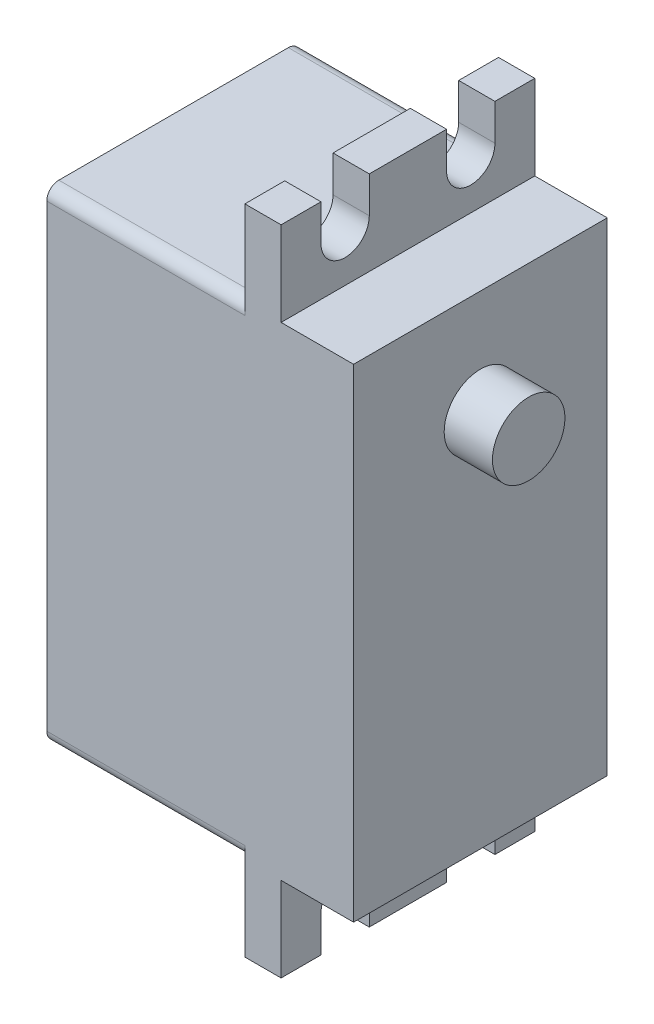
ISO-10303-21;
HEADER;
FILE_DESCRIPTION(('STEP AP214'),'2;1');
FILE_NAME('part.step','',(''),(''),'','','');
FILE_SCHEMA(('AUTOMOTIVE_DESIGN { 1 0 10303 214 1 1 1 1 }'));
ENDSEC;
DATA;
#1=APPLICATION_CONTEXT('core data for automotive mechanical design processes');
#2=APPLICATION_PROTOCOL_DEFINITION('international standard','automotive_design',2000,#1);
#3=PRODUCT_CONTEXT('',#1,'mechanical');
#4=PRODUCT('Part','Part','',(#3));
#5=PRODUCT_RELATED_PRODUCT_CATEGORY('part','',(#4));
#6=PRODUCT_DEFINITION_FORMATION('','',#4);
#7=PRODUCT_DEFINITION_CONTEXT('part definition',#1,'design');
#8=PRODUCT_DEFINITION('design','',#6,#7);
#9=PRODUCT_DEFINITION_SHAPE('','',#8);
#10=(LENGTH_UNIT() NAMED_UNIT(*) SI_UNIT(.MILLI.,.METRE.));
#11=(NAMED_UNIT(*) PLANE_ANGLE_UNIT() SI_UNIT($,.RADIAN.));
#12=(NAMED_UNIT(*) SI_UNIT($,.STERADIAN.) SOLID_ANGLE_UNIT());
#13=UNCERTAINTY_MEASURE_WITH_UNIT(LENGTH_MEASURE(1.E-05),#10,'distance_accuracy_value','');
#14=(GEOMETRIC_REPRESENTATION_CONTEXT(3) GLOBAL_UNCERTAINTY_ASSIGNED_CONTEXT((#13)) GLOBAL_UNIT_ASSIGNED_CONTEXT((#10,
#11,#12)) REPRESENTATION_CONTEXT('',''));
#15=CARTESIAN_POINT('',(0.,0.,0.));
#16=DIRECTION('',(0.,0.,1.));
#17=DIRECTION('',(1.,0.,0.));
#18=AXIS2_PLACEMENT_3D('',#15,#16,#17);
#19=CARTESIAN_POINT('',(19.4,0.,0.));
#20=DIRECTION('',(-1.,0.,0.));
#21=DIRECTION('',(0.,0.,1.));
#22=AXIS2_PLACEMENT_3D('',#19,#20,#21);
#23=PLANE('',#22);
#24=DIRECTION('',(0.,0.,-1.));
#25=VECTOR('',#24,1.);
#26=CARTESIAN_POINT('',(19.4,-20.,10.5));
#27=LINE('',#26,#25);
#28=CARTESIAN_POINT('',(19.4,-20.,10.5));
#29=VERTEX_POINT('',#28);
#30=CARTESIAN_POINT('',(19.4,-20.,-10.5));
#31=VERTEX_POINT('',#30);
#32=EDGE_CURVE('E260',#29,#31,#27,.T.);
#33=ORIENTED_EDGE('',*,*,#32,.F.);
#34=DIRECTION('',(0.,-1.,0.));
#35=VECTOR('',#34,1.);
#36=CARTESIAN_POINT('',(19.4,-27.,10.5));
#37=LINE('',#36,#35);
#38=CARTESIAN_POINT('',(19.4,-27.,10.5));
#39=VERTEX_POINT('',#38);
#40=EDGE_CURVE('E385',#29,#39,#37,.T.);
#41=ORIENTED_EDGE('',*,*,#40,.T.);
#42=DIRECTION('',(0.,0.,-1.));
#43=VECTOR('',#42,1.);
#44=CARTESIAN_POINT('',(19.4,-27.,10.5));
#45=LINE('',#44,#43);
#46=CARTESIAN_POINT('',(19.4,-27.,7.200000014));
#47=VERTEX_POINT('',#46);
#48=EDGE_CURVE('E390',#39,#47,#45,.T.);
#49=ORIENTED_EDGE('',*,*,#48,.T.);
#50=DIRECTION('',(0.,1.,0.));
#51=VECTOR('',#50,1.);
#52=CARTESIAN_POINT('',(19.4,-24.,7.200000014));
#53=LINE('',#52,#51);
#54=CARTESIAN_POINT('',(19.4,-24.,7.200000014));
#55=VERTEX_POINT('',#54);
#56=EDGE_CURVE('E279',#47,#55,#53,.T.);
#57=ORIENTED_EDGE('',*,*,#56,.T.);
#58=CARTESIAN_POINT('',(19.4,-24.,5.200000014));
#59=DIRECTION('',(-1.,0.,0.));
#60=DIRECTION('',(0.,0.,1.));
#61=AXIS2_PLACEMENT_3D('',#58,#59,#60);
#62=CIRCLE('',#61,2.);
#63=CARTESIAN_POINT('',(19.4,-24.,3.200000014));
#64=VERTEX_POINT('',#63);
#65=EDGE_CURVE('E276',#55,#64,#62,.T.);
#66=ORIENTED_EDGE('',*,*,#65,.T.);
#67=DIRECTION('',(0.,-1.,0.));
#68=VECTOR('',#67,1.);
#69=CARTESIAN_POINT('',(19.4,-24.,3.200000014));
#70=LINE('',#69,#68);
#71=CARTESIAN_POINT('',(19.4,-27.,3.200000014));
#72=VERTEX_POINT('',#71);
#73=EDGE_CURVE('E282',#64,#72,#70,.T.);
#74=ORIENTED_EDGE('',*,*,#73,.T.);
#75=CARTESIAN_POINT('',(19.4,-27.,-3.200000014));
#76=VERTEX_POINT('',#75);
#77=EDGE_CURVE('E394',#72,#76,#45,.T.);
#78=ORIENTED_EDGE('',*,*,#77,.T.);
#79=DIRECTION('',(0.,-1.,0.));
#80=VECTOR('',#79,1.);
#81=CARTESIAN_POINT('',(19.4,-24.,-3.200000014));
#82=LINE('',#81,#80);
#83=CARTESIAN_POINT('',(19.4,-24.,-3.200000014));
#84=VERTEX_POINT('',#83);
#85=EDGE_CURVE('E306',#84,#76,#82,.T.);
#86=ORIENTED_EDGE('',*,*,#85,.F.);
#87=CARTESIAN_POINT('',(19.4,-24.,-5.200000014));
#88=DIRECTION('',(1.,0.,0.));
#89=DIRECTION('',(0.,0.,-1.));
#90=AXIS2_PLACEMENT_3D('',#87,#88,#89);
#91=CIRCLE('',#90,2.);
#92=CARTESIAN_POINT('',(19.4,-24.,-7.200000014));
#93=VERTEX_POINT('',#92);
#94=EDGE_CURVE('E303',#93,#84,#91,.T.);
#95=ORIENTED_EDGE('',*,*,#94,.F.);
#96=DIRECTION('',(0.,1.,0.));
#97=VECTOR('',#96,1.);
#98=CARTESIAN_POINT('',(19.4,-24.,-7.200000014));
#99=LINE('',#98,#97);
#100=CARTESIAN_POINT('',(19.4,-27.,-7.200000014));
#101=VERTEX_POINT('',#100);
#102=EDGE_CURVE('E309',#101,#93,#99,.T.);
#103=ORIENTED_EDGE('',*,*,#102,.F.);
#104=CARTESIAN_POINT('',(19.4,-27.,-10.5));
#105=VERTEX_POINT('',#104);
#106=EDGE_CURVE('E389',#101,#105,#45,.T.);
#107=ORIENTED_EDGE('',*,*,#106,.T.);
#108=DIRECTION('',(0.,1.,0.));
#109=VECTOR('',#108,1.);
#110=CARTESIAN_POINT('',(19.4,-27.,-10.5));
#111=LINE('',#110,#109);
#112=EDGE_CURVE('E379',#105,#31,#111,.T.);
#113=ORIENTED_EDGE('',*,*,#112,.T.);
#114=EDGE_LOOP('',(#33,#41,#49,#57,#66,#74,#78,#86,#95,#103,#107,#113));
#115=FACE_BOUND('',#114,.T.);
#116=ADVANCED_FACE('F32',(#115),#23,.F.);
#117=DIRECTION('',(0.,0.,1.));
#118=VECTOR('',#117,1.);
#119=CARTESIAN_POINT('',(19.4,20.,10.5));
#120=LINE('',#119,#118);
#121=CARTESIAN_POINT('',(19.4,20.,-10.5));
#122=VERTEX_POINT('',#121);
#123=CARTESIAN_POINT('',(19.4,20.,10.5));
#124=VERTEX_POINT('',#123);
#125=EDGE_CURVE('E853',#122,#124,#120,.T.);
#126=ORIENTED_EDGE('',*,*,#125,.F.);
#127=CARTESIAN_POINT('',(19.4,27.,-10.5));
#128=VERTEX_POINT('',#127);
#129=EDGE_CURVE('E265',#122,#128,#111,.T.);
#130=ORIENTED_EDGE('',*,*,#129,.T.);
#131=DIRECTION('',(0.,0.,1.));
#132=VECTOR('',#131,1.);
#133=CARTESIAN_POINT('',(19.4,27.,10.5));
#134=LINE('',#133,#132);
#135=CARTESIAN_POINT('',(19.4,27.,-7.200000014));
#136=VERTEX_POINT('',#135);
#137=EDGE_CURVE('E382',#128,#136,#134,.T.);
#138=ORIENTED_EDGE('',*,*,#137,.T.);
#139=DIRECTION('',(0.,-1.,0.));
#140=VECTOR('',#139,1.);
#141=CARTESIAN_POINT('',(19.4,24.,-7.200000014));
#142=LINE('',#141,#140);
#143=CARTESIAN_POINT('',(19.4,24.,-7.200000014));
#144=VERTEX_POINT('',#143);
#145=EDGE_CURVE('E332',#136,#144,#142,.T.);
#146=ORIENTED_EDGE('',*,*,#145,.T.);
#147=CARTESIAN_POINT('',(19.4,24.,-5.200000014));
#148=DIRECTION('',(-1.,0.,0.));
#149=DIRECTION('',(0.,0.,-1.));
#150=AXIS2_PLACEMENT_3D('',#147,#148,#149);
#151=CIRCLE('',#150,2.);
#152=CARTESIAN_POINT('',(19.4,24.,-3.200000014));
#153=VERTEX_POINT('',#152);
#154=EDGE_CURVE('E329',#144,#153,#151,.T.);
#155=ORIENTED_EDGE('',*,*,#154,.T.);
#156=DIRECTION('',(0.,1.,0.));
#157=VECTOR('',#156,1.);
#158=CARTESIAN_POINT('',(19.4,24.,-3.200000014));
#159=LINE('',#158,#157);
#160=CARTESIAN_POINT('',(19.4,27.,-3.200000014));
#161=VERTEX_POINT('',#160);
#162=EDGE_CURVE('E335',#153,#161,#159,.T.);
#163=ORIENTED_EDGE('',*,*,#162,.T.);
#164=CARTESIAN_POINT('',(19.4,27.,3.200000014));
#165=VERTEX_POINT('',#164);
#166=EDGE_CURVE('E386',#161,#165,#134,.T.);
#167=ORIENTED_EDGE('',*,*,#166,.T.);
#168=DIRECTION('',(0.,1.,0.));
#169=VECTOR('',#168,1.);
#170=CARTESIAN_POINT('',(19.4,24.,3.200000014));
#171=LINE('',#170,#169);
#172=CARTESIAN_POINT('',(19.4,24.,3.200000014));
#173=VERTEX_POINT('',#172);
#174=EDGE_CURVE('E359',#173,#165,#171,.T.);
#175=ORIENTED_EDGE('',*,*,#174,.F.);
#176=CARTESIAN_POINT('',(19.4,24.,5.200000014));
#177=DIRECTION('',(1.,0.,0.));
#178=DIRECTION('',(0.,0.,1.));
#179=AXIS2_PLACEMENT_3D('',#176,#177,#178);
#180=CIRCLE('',#179,2.);
#181=CARTESIAN_POINT('',(19.4,24.,7.200000014));
#182=VERTEX_POINT('',#181);
#183=EDGE_CURVE('E357',#182,#173,#180,.T.);
#184=ORIENTED_EDGE('',*,*,#183,.F.);
#185=DIRECTION('',(0.,-1.,0.));
#186=VECTOR('',#185,1.);
#187=CARTESIAN_POINT('',(19.4,24.,7.200000014));
#188=LINE('',#187,#186);
#189=CARTESIAN_POINT('',(19.4,27.,7.200000014));
#190=VERTEX_POINT('',#189);
#191=EDGE_CURVE('E362',#190,#182,#188,.T.);
#192=ORIENTED_EDGE('',*,*,#191,.F.);
#193=CARTESIAN_POINT('',(19.4,27.,10.5));
#194=VERTEX_POINT('',#193);
#195=EDGE_CURVE('E381',#190,#194,#134,.T.);
#196=ORIENTED_EDGE('',*,*,#195,.T.);
#197=EDGE_CURVE('E387',#194,#124,#37,.T.);
#198=ORIENTED_EDGE('',*,*,#197,.T.);
#199=EDGE_LOOP('',(#126,#130,#138,#146,#155,#163,#167,#175,#184,#192,#196,#198));
#200=FACE_BOUND('',#199,.T.);
#201=ADVANCED_FACE('F521',(#200),#23,.F.);
#202=CARTESIAN_POINT('',(19.4,-27.,10.5));
#203=DIRECTION('',(0.,1.,0.));
#204=DIRECTION('',(0.,0.,1.));
#205=AXIS2_PLACEMENT_3D('',#202,#203,#204);
#206=PLANE('',#205);
#207=DIRECTION('',(1.,0.,0.));
#208=VECTOR('',#207,1.);
#209=CARTESIAN_POINT('',(-0.001000000000001,-27.,3.200000014));
#210=LINE('',#209,#208);
#211=CARTESIAN_POINT('',(16.4,-27.,3.200000014));
#212=VERTEX_POINT('',#211);
#213=EDGE_CURVE('E289',#212,#72,#210,.T.);
#214=ORIENTED_EDGE('',*,*,#213,.F.);
#215=DIRECTION('',(0.,0.,-1.));
#216=VECTOR('',#215,1.);
#217=CARTESIAN_POINT('',(16.4,-27.,10.5));
#218=LINE('',#217,#216);
#219=CARTESIAN_POINT('',(16.4,-27.,-3.200000014));
#220=VERTEX_POINT('',#219);
#221=EDGE_CURVE('E409',#212,#220,#218,.T.);
#222=ORIENTED_EDGE('',*,*,#221,.T.);
#223=DIRECTION('',(1.,0.,0.));
#224=VECTOR('',#223,1.);
#225=CARTESIAN_POINT('',(-0.001000000000001,-27.,-3.200000014));
#226=LINE('',#225,#224);
#227=EDGE_CURVE('E318',#220,#76,#226,.T.);
#228=ORIENTED_EDGE('',*,*,#227,.T.);
#229=ORIENTED_EDGE('',*,*,#77,.F.);
#230=EDGE_LOOP('',(#214,#222,#228,#229));
#231=FACE_BOUND('',#230,.T.);
#232=ADVANCED_FACE('F527',(#231),#206,.F.);
#233=DIRECTION('',(1.,0.,0.));
#234=VECTOR('',#233,1.);
#235=CARTESIAN_POINT('',(-0.001000000000001,-27.,7.200000014));
#236=LINE('',#235,#234);
#237=CARTESIAN_POINT('',(16.4,-27.,7.200000014));
#238=VERTEX_POINT('',#237);
#239=EDGE_CURVE('E291',#238,#47,#236,.T.);
#240=ORIENTED_EDGE('',*,*,#239,.T.);
#241=ORIENTED_EDGE('',*,*,#48,.F.);
#242=DIRECTION('',(-1.,0.,0.));
#243=VECTOR('',#242,1.);
#244=CARTESIAN_POINT('',(19.4,-27.,10.5));
#245=LINE('',#244,#243);
#246=CARTESIAN_POINT('',(16.4,-27.,10.5));
#247=VERTEX_POINT('',#246);
#248=EDGE_CURVE('E412',#39,#247,#245,.T.);
#249=ORIENTED_EDGE('',*,*,#248,.T.);
#250=EDGE_CURVE('E406',#247,#238,#218,.T.);
#251=ORIENTED_EDGE('',*,*,#250,.T.);
#252=EDGE_LOOP('',(#240,#241,#249,#251));
#253=FACE_BOUND('',#252,.T.);
#254=ADVANCED_FACE('F536',(#253),#206,.F.);
#255=CARTESIAN_POINT('',(16.4,0.,0.));
#256=DIRECTION('',(-1.,0.,0.));
#257=DIRECTION('',(0.,0.,1.));
#258=AXIS2_PLACEMENT_3D('',#255,#256,#257);
#259=PLANE('',#258);
#260=ORIENTED_EDGE('',*,*,#221,.F.);
#261=DIRECTION('',(0.,-1.,0.));
#262=VECTOR('',#261,1.);
#263=CARTESIAN_POINT('',(16.4,-24.,3.200000014));
#264=LINE('',#263,#262);
#265=CARTESIAN_POINT('',(16.4,-24.,3.200000014));
#266=VERTEX_POINT('',#265);
#267=EDGE_CURVE('E269',#266,#212,#264,.T.);
#268=ORIENTED_EDGE('',*,*,#267,.F.);
#269=CARTESIAN_POINT('',(16.4,-24.,5.200000014));
#270=DIRECTION('',(-1.,0.,0.));
#271=DIRECTION('',(0.,0.,1.));
#272=AXIS2_PLACEMENT_3D('',#269,#270,#271);
#273=CIRCLE('',#272,2.);
#274=CARTESIAN_POINT('',(16.4,-24.,7.200000014));
#275=VERTEX_POINT('',#274);
#276=EDGE_CURVE('E266',#275,#266,#273,.T.);
#277=ORIENTED_EDGE('',*,*,#276,.F.);
#278=DIRECTION('',(0.,1.,0.));
#279=VECTOR('',#278,1.);
#280=CARTESIAN_POINT('',(16.4,-24.,7.200000014));
#281=LINE('',#280,#279);
#282=EDGE_CURVE('E288',#238,#275,#281,.T.);
#283=ORIENTED_EDGE('',*,*,#282,.F.);
#284=ORIENTED_EDGE('',*,*,#250,.F.);
#285=DIRECTION('',(0.,-1.,0.));
#286=VECTOR('',#285,1.);
#287=CARTESIAN_POINT('',(16.4,-27.,10.5));
#288=LINE('',#287,#286);
#289=CARTESIAN_POINT('',(16.4,-19.,10.5));
#290=VERTEX_POINT('',#289);
#291=EDGE_CURVE('E401',#290,#247,#288,.T.);
#292=ORIENTED_EDGE('',*,*,#291,.F.);
#293=CARTESIAN_POINT('',(16.4,-19.,9.5));
#294=DIRECTION('',(-1.,0.,0.));
#295=DIRECTION('',(0.,0.,1.));
#296=AXIS2_PLACEMENT_3D('',#293,#294,#295);
#297=CIRCLE('',#296,1.);
#298=CARTESIAN_POINT('',(16.4,-20.,9.5));
#299=VERTEX_POINT('',#298);
#300=EDGE_CURVE('E469',#290,#299,#297,.F.);
#301=ORIENTED_EDGE('',*,*,#300,.T.);
#302=DIRECTION('',(0.,0.,-1.));
#303=VECTOR('',#302,1.);
#304=CARTESIAN_POINT('',(16.4,-20.,10.5));
#305=LINE('',#304,#303);
#306=CARTESIAN_POINT('',(16.4,-20.,-9.5));
#307=VERTEX_POINT('',#306);
#308=EDGE_CURVE('E424',#299,#307,#305,.T.);
#309=ORIENTED_EDGE('',*,*,#308,.T.);
#310=CARTESIAN_POINT('',(16.4,-19.,-9.50000000000001));
#311=DIRECTION('',(-1.,0.,0.));
#312=DIRECTION('',(0.,0.,1.));
#313=AXIS2_PLACEMENT_3D('',#310,#311,#312);
#314=CIRCLE('',#313,1.);
#315=CARTESIAN_POINT('',(16.4,-19.,-10.5));
#316=VERTEX_POINT('',#315);
#317=EDGE_CURVE('E471',#307,#316,#314,.F.);
#318=ORIENTED_EDGE('',*,*,#317,.T.);
#319=DIRECTION('',(0.,1.,0.));
#320=VECTOR('',#319,1.);
#321=CARTESIAN_POINT('',(16.4,-27.,-10.5));
#322=LINE('',#321,#320);
#323=CARTESIAN_POINT('',(16.4,-27.,-10.5));
#324=VERTEX_POINT('',#323);
#325=EDGE_CURVE('E395',#324,#316,#322,.T.);
#326=ORIENTED_EDGE('',*,*,#325,.F.);
#327=CARTESIAN_POINT('',(16.4,-27.,-7.200000014));
#328=VERTEX_POINT('',#327);
#329=EDGE_CURVE('E405',#328,#324,#218,.T.);
#330=ORIENTED_EDGE('',*,*,#329,.F.);
#331=DIRECTION('',(0.,1.,0.));
#332=VECTOR('',#331,1.);
#333=CARTESIAN_POINT('',(16.4,-24.,-7.200000014));
#334=LINE('',#333,#332);
#335=CARTESIAN_POINT('',(16.4,-24.,-7.200000014));
#336=VERTEX_POINT('',#335);
#337=EDGE_CURVE('E300',#328,#336,#334,.T.);
#338=ORIENTED_EDGE('',*,*,#337,.T.);
#339=CARTESIAN_POINT('',(16.4,-24.,-5.200000014));
#340=DIRECTION('',(-1.,0.,0.));
#341=DIRECTION('',(0.,0.,1.));
#342=AXIS2_PLACEMENT_3D('',#339,#340,#341);
#343=CIRCLE('',#342,2.);
#344=CARTESIAN_POINT('',(16.4,-24.,-3.200000014));
#345=VERTEX_POINT('',#344);
#346=EDGE_CURVE('E297',#336,#345,#343,.F.);
#347=ORIENTED_EDGE('',*,*,#346,.T.);
#348=DIRECTION('',(0.,-1.,0.));
#349=VECTOR('',#348,1.);
#350=CARTESIAN_POINT('',(16.4,-24.,-3.200000014));
#351=LINE('',#350,#349);
#352=EDGE_CURVE('E315',#345,#220,#351,.T.);
#353=ORIENTED_EDGE('',*,*,#352,.T.);
#354=EDGE_LOOP('',(#260,#268,#277,#283,#284,#292,#301,#309,#318,#326,#330,#338,#347,#353));
#355=FACE_BOUND('',#354,.T.);
#356=ADVANCED_FACE('F501',(#355),#259,.T.);
#357=ORIENTED_EDGE('',*,*,#106,.F.);
#358=DIRECTION('',(1.,0.,0.));
#359=VECTOR('',#358,1.);
#360=CARTESIAN_POINT('',(-0.001000000000001,-27.,-7.200000014));
#361=LINE('',#360,#359);
#362=EDGE_CURVE('E316',#328,#101,#361,.T.);
#363=ORIENTED_EDGE('',*,*,#362,.F.);
#364=ORIENTED_EDGE('',*,*,#329,.T.);
#365=DIRECTION('',(-1.,0.,0.));
#366=VECTOR('',#365,1.);
#367=CARTESIAN_POINT('',(19.4,-27.,-10.5));
#368=LINE('',#367,#366);
#369=EDGE_CURVE('E393',#105,#324,#368,.T.);
#370=ORIENTED_EDGE('',*,*,#369,.F.);
#371=EDGE_LOOP('',(#357,#363,#364,#370));
#372=FACE_BOUND('',#371,.T.);
#373=ADVANCED_FACE('F535',(#372),#206,.F.);
#374=DIRECTION('',(0.,0.,1.));
#375=VECTOR('',#374,1.);
#376=CARTESIAN_POINT('',(16.4,27.,10.5));
#377=LINE('',#376,#375);
#378=CARTESIAN_POINT('',(16.4,27.,-3.200000014));
#379=VERTEX_POINT('',#378);
#380=CARTESIAN_POINT('',(16.4,27.,3.200000014));
#381=VERTEX_POINT('',#380);
#382=EDGE_CURVE('E402',#379,#381,#377,.T.);
#383=ORIENTED_EDGE('',*,*,#382,.F.);
#384=DIRECTION('',(0.,1.,0.));
#385=VECTOR('',#384,1.);
#386=CARTESIAN_POINT('',(16.4,24.,-3.200000014));
#387=LINE('',#386,#385);
#388=CARTESIAN_POINT('',(16.4,24.,-3.200000014));
#389=VERTEX_POINT('',#388);
#390=EDGE_CURVE('E327',#389,#379,#387,.T.);
#391=ORIENTED_EDGE('',*,*,#390,.F.);
#392=CARTESIAN_POINT('',(16.4,24.,-5.200000014));
#393=DIRECTION('',(-1.,0.,0.));
#394=DIRECTION('',(0.,0.,1.));
#395=AXIS2_PLACEMENT_3D('',#392,#393,#394);
#396=CIRCLE('',#395,2.);
#397=CARTESIAN_POINT('',(16.4,24.,-7.200000014));
#398=VERTEX_POINT('',#397);
#399=EDGE_CURVE('E324',#398,#389,#396,.T.);
#400=ORIENTED_EDGE('',*,*,#399,.F.);
#401=DIRECTION('',(0.,-1.,0.));
#402=VECTOR('',#401,1.);
#403=CARTESIAN_POINT('',(16.4,24.,-7.200000014));
#404=LINE('',#403,#402);
#405=CARTESIAN_POINT('',(16.4,27.,-7.200000014));
#406=VERTEX_POINT('',#405);
#407=EDGE_CURVE('E341',#406,#398,#404,.T.);
#408=ORIENTED_EDGE('',*,*,#407,.F.);
#409=CARTESIAN_POINT('',(16.4,27.,-10.5));
#410=VERTEX_POINT('',#409);
#411=EDGE_CURVE('E398',#410,#406,#377,.T.);
#412=ORIENTED_EDGE('',*,*,#411,.F.);
#413=CARTESIAN_POINT('',(16.4,19.,-10.5));
#414=VERTEX_POINT('',#413);
#415=EDGE_CURVE('E378',#414,#410,#322,.T.);
#416=ORIENTED_EDGE('',*,*,#415,.F.);
#417=CARTESIAN_POINT('',(16.4,19.,-9.5));
#418=DIRECTION('',(-1.,0.,0.));
#419=DIRECTION('',(0.,0.,1.));
#420=AXIS2_PLACEMENT_3D('',#417,#418,#419);
#421=CIRCLE('',#420,1.);
#422=CARTESIAN_POINT('',(16.4,20.,-9.5));
#423=VERTEX_POINT('',#422);
#424=EDGE_CURVE('E11',#414,#423,#421,.F.);
#425=ORIENTED_EDGE('',*,*,#424,.T.);
#426=DIRECTION('',(0.,0.,1.));
#427=VECTOR('',#426,1.);
#428=CARTESIAN_POINT('',(16.4,20.,10.5));
#429=LINE('',#428,#427);
#430=CARTESIAN_POINT('',(16.4,20.,9.5));
#431=VERTEX_POINT('',#430);
#432=EDGE_CURVE('E422',#423,#431,#429,.T.);
#433=ORIENTED_EDGE('',*,*,#432,.T.);
#434=CARTESIAN_POINT('',(16.4,19.,9.5));
#435=DIRECTION('',(-1.,0.,0.));
#436=DIRECTION('',(0.,0.,1.));
#437=AXIS2_PLACEMENT_3D('',#434,#435,#436);
#438=CIRCLE('',#437,1.);
#439=CARTESIAN_POINT('',(16.4,19.,10.5));
#440=VERTEX_POINT('',#439);
#441=EDGE_CURVE('E40',#431,#440,#438,.F.);
#442=ORIENTED_EDGE('',*,*,#441,.T.);
#443=CARTESIAN_POINT('',(16.4,27.,10.5));
#444=VERTEX_POINT('',#443);
#445=EDGE_CURVE('E403',#444,#440,#288,.T.);
#446=ORIENTED_EDGE('',*,*,#445,.F.);
#447=CARTESIAN_POINT('',(16.4,27.,7.200000014));
#448=VERTEX_POINT('',#447);
#449=EDGE_CURVE('E397',#448,#444,#377,.T.);
#450=ORIENTED_EDGE('',*,*,#449,.F.);
#451=DIRECTION('',(0.,-1.,0.));
#452=VECTOR('',#451,1.);
#453=CARTESIAN_POINT('',(16.4,24.,7.200000014));
#454=LINE('',#453,#452);
#455=CARTESIAN_POINT('',(16.4,24.,7.200000014));
#456=VERTEX_POINT('',#455);
#457=EDGE_CURVE('E354',#448,#456,#454,.T.);
#458=ORIENTED_EDGE('',*,*,#457,.T.);
#459=CARTESIAN_POINT('',(16.4,24.,5.200000014));
#460=DIRECTION('',(-1.,0.,0.));
#461=DIRECTION('',(0.,0.,1.));
#462=AXIS2_PLACEMENT_3D('',#459,#460,#461);
#463=CIRCLE('',#462,2.);
#464=CARTESIAN_POINT('',(16.4,24.,3.200000014));
#465=VERTEX_POINT('',#464);
#466=EDGE_CURVE('E351',#456,#465,#463,.F.);
#467=ORIENTED_EDGE('',*,*,#466,.T.);
#468=DIRECTION('',(0.,1.,0.));
#469=VECTOR('',#468,1.);
#470=CARTESIAN_POINT('',(16.4,24.,3.200000014));
#471=LINE('',#470,#469);
#472=EDGE_CURVE('E368',#465,#381,#471,.T.);
#473=ORIENTED_EDGE('',*,*,#472,.T.);
#474=EDGE_LOOP('',(#383,#391,#400,#408,#412,#416,#425,#433,#442,#446,#450,#458,#467,#473));
#475=FACE_BOUND('',#474,.T.);
#476=ADVANCED_FACE('F478',(#475),#259,.T.);
#477=CARTESIAN_POINT('',(19.4,27.,10.5));
#478=DIRECTION('',(0.,-1.,0.));
#479=DIRECTION('',(0.,0.,-1.));
#480=AXIS2_PLACEMENT_3D('',#477,#478,#479);
#481=PLANE('',#480);
#482=DIRECTION('',(1.,0.,0.));
#483=VECTOR('',#482,1.);
#484=CARTESIAN_POINT('',(-0.001000000000001,27.,-3.200000014));
#485=LINE('',#484,#483);
#486=EDGE_CURVE('E342',#379,#161,#485,.T.);
#487=ORIENTED_EDGE('',*,*,#486,.F.);
#488=ORIENTED_EDGE('',*,*,#382,.T.);
#489=DIRECTION('',(1.,0.,0.));
#490=VECTOR('',#489,1.);
#491=CARTESIAN_POINT('',(-0.001000000000001,27.,3.200000014));
#492=LINE('',#491,#490);
#493=EDGE_CURVE('E371',#381,#165,#492,.T.);
#494=ORIENTED_EDGE('',*,*,#493,.T.);
#495=ORIENTED_EDGE('',*,*,#166,.F.);
#496=EDGE_LOOP('',(#487,#488,#494,#495));
#497=FACE_BOUND('',#496,.T.);
#498=ADVANCED_FACE('F540',(#497),#481,.F.);
#499=DIRECTION('',(1.,0.,0.));
#500=VECTOR('',#499,1.);
#501=CARTESIAN_POINT('',(-0.001000000000001,27.,-7.200000014));
#502=LINE('',#501,#500);
#503=EDGE_CURVE('E344',#406,#136,#502,.T.);
#504=ORIENTED_EDGE('',*,*,#503,.T.);
#505=ORIENTED_EDGE('',*,*,#137,.F.);
#506=DIRECTION('',(-1.,0.,0.));
#507=VECTOR('',#506,1.);
#508=CARTESIAN_POINT('',(19.4,27.,-10.5));
#509=LINE('',#508,#507);
#510=EDGE_CURVE('E418',#128,#410,#509,.T.);
#511=ORIENTED_EDGE('',*,*,#510,.T.);
#512=ORIENTED_EDGE('',*,*,#411,.T.);
#513=EDGE_LOOP('',(#504,#505,#511,#512));
#514=FACE_BOUND('',#513,.T.);
#515=ADVANCED_FACE('F543',(#514),#481,.F.);
#516=ORIENTED_EDGE('',*,*,#195,.F.);
#517=DIRECTION('',(1.,0.,0.));
#518=VECTOR('',#517,1.);
#519=CARTESIAN_POINT('',(-0.001000000000001,27.,7.200000014));
#520=LINE('',#519,#518);
#521=EDGE_CURVE('E369',#448,#190,#520,.T.);
#522=ORIENTED_EDGE('',*,*,#521,.F.);
#523=ORIENTED_EDGE('',*,*,#449,.T.);
#524=DIRECTION('',(-1.,0.,0.));
#525=VECTOR('',#524,1.);
#526=CARTESIAN_POINT('',(19.4,27.,10.5));
#527=LINE('',#526,#525);
#528=EDGE_CURVE('E415',#194,#444,#527,.T.);
#529=ORIENTED_EDGE('',*,*,#528,.F.);
#530=EDGE_LOOP('',(#516,#522,#523,#529));
#531=FACE_BOUND('',#530,.T.);
#532=ADVANCED_FACE('F518',(#531),#481,.F.);
#533=CARTESIAN_POINT('',(16.4,20.,-10.5));
#534=DIRECTION('',(0.,0.,1.));
#535=DIRECTION('',(0.,-1.,0.));
#536=AXIS2_PLACEMENT_3D('',#533,#534,#535);
#537=PLANE('',#536);
#538=ORIENTED_EDGE('',*,*,#325,.T.);
#539=DIRECTION('',(-1.,0.,0.));
#540=VECTOR('',#539,1.);
#541=CARTESIAN_POINT('',(16.4,-19.,-10.5));
#542=LINE('',#541,#540);
#543=CARTESIAN_POINT('',(0.,-19.,-10.5));
#544=VERTEX_POINT('',#543);
#545=EDGE_CURVE('E462',#316,#544,#542,.T.);
#546=ORIENTED_EDGE('',*,*,#545,.T.);
#547=DIRECTION('',(0.,1.,0.));
#548=VECTOR('',#547,1.);
#549=CARTESIAN_POINT('',(0.,20.,-10.5));
#550=LINE('',#549,#548);
#551=CARTESIAN_POINT('',(0.,19.,-10.5));
#552=VERTEX_POINT('',#551);
#553=EDGE_CURVE('E421',#544,#552,#550,.T.);
#554=ORIENTED_EDGE('',*,*,#553,.T.);
#555=DIRECTION('',(-1.,0.,0.));
#556=VECTOR('',#555,1.);
#557=CARTESIAN_POINT('',(16.4,19.,-10.5));
#558=LINE('',#557,#556);
#559=EDGE_CURVE('E459',#552,#414,#558,.F.);
#560=ORIENTED_EDGE('',*,*,#559,.T.);
#561=ORIENTED_EDGE('',*,*,#415,.T.);
#562=ORIENTED_EDGE('',*,*,#510,.F.);
#563=ORIENTED_EDGE('',*,*,#129,.F.);
#564=DIRECTION('',(-1.,0.,0.));
#565=VECTOR('',#564,1.);
#566=CARTESIAN_POINT('',(25.4,20.,-10.5));
#567=LINE('',#566,#565);
#568=CARTESIAN_POINT('',(25.4,20.,-10.5));
#569=VERTEX_POINT('',#568);
#570=EDGE_CURVE('E245',#569,#122,#567,.T.);
#571=ORIENTED_EDGE('',*,*,#570,.F.);
#572=DIRECTION('',(0.,1.,0.));
#573=VECTOR('',#572,1.);
#574=CARTESIAN_POINT('',(25.4,-20.,-10.5));
#575=LINE('',#574,#573);
#576=CARTESIAN_POINT('',(25.4,-20.,-10.5));
#577=VERTEX_POINT('',#576);
#578=EDGE_CURVE('E251',#577,#569,#575,.T.);
#579=ORIENTED_EDGE('',*,*,#578,.F.);
#580=DIRECTION('',(-1.,0.,0.));
#581=VECTOR('',#580,1.);
#582=CARTESIAN_POINT('',(25.4,-20.,-10.5));
#583=LINE('',#582,#581);
#584=EDGE_CURVE('E863',#577,#31,#583,.T.);
#585=ORIENTED_EDGE('',*,*,#584,.T.);
#586=ORIENTED_EDGE('',*,*,#112,.F.);
#587=ORIENTED_EDGE('',*,*,#369,.T.);
#588=EDGE_LOOP('',(#538,#546,#554,#560,#561,#562,#563,#571,#579,#585,#586,#587));
#589=FACE_BOUND('',#588,.T.);
#590=ADVANCED_FACE('F263',(#589),#537,.F.);
#591=CARTESIAN_POINT('',(16.4,20.,10.5));
#592=DIRECTION('',(0.,-1.,0.));
#593=DIRECTION('',(0.,0.,-1.));
#594=AXIS2_PLACEMENT_3D('',#591,#592,#593);
#595=PLANE('',#594);
#596=DIRECTION('',(0.,0.,1.));
#597=VECTOR('',#596,1.);
#598=CARTESIAN_POINT('',(0.,20.,10.5));
#599=LINE('',#598,#597);
#600=CARTESIAN_POINT('',(0.,20.,-9.5));
#601=VERTEX_POINT('',#600);
#602=CARTESIAN_POINT('',(0.,20.,9.5));
#603=VERTEX_POINT('',#602);
#604=EDGE_CURVE('E431',#601,#603,#599,.T.);
#605=ORIENTED_EDGE('',*,*,#604,.T.);
#606=DIRECTION('',(-1.,0.,0.));
#607=VECTOR('',#606,1.);
#608=CARTESIAN_POINT('',(16.4,20.,9.5));
#609=LINE('',#608,#607);
#610=EDGE_CURVE('E47',#603,#431,#609,.F.);
#611=ORIENTED_EDGE('',*,*,#610,.T.);
#612=ORIENTED_EDGE('',*,*,#432,.F.);
#613=DIRECTION('',(-1.,0.,0.));
#614=VECTOR('',#613,1.);
#615=CARTESIAN_POINT('',(16.4,20.,-9.5));
#616=LINE('',#615,#614);
#617=EDGE_CURVE('E465',#423,#601,#616,.T.);
#618=ORIENTED_EDGE('',*,*,#617,.T.);
#619=EDGE_LOOP('',(#605,#611,#612,#618));
#620=FACE_BOUND('',#619,.T.);
#621=ADVANCED_FACE('F510',(#620),#595,.F.);
#622=CARTESIAN_POINT('',(16.4,20.,10.5));
#623=DIRECTION('',(0.,0.,-1.));
#624=DIRECTION('',(0.,1.,0.));
#625=AXIS2_PLACEMENT_3D('',#622,#623,#624);
#626=PLANE('',#625);
#627=DIRECTION('',(0.,-1.,0.));
#628=VECTOR('',#627,1.);
#629=CARTESIAN_POINT('',(0.,20.,10.5));
#630=LINE('',#629,#628);
#631=CARTESIAN_POINT('',(0.,19.,10.5));
#632=VERTEX_POINT('',#631);
#633=CARTESIAN_POINT('',(0.,-19.,10.5));
#634=VERTEX_POINT('',#633);
#635=EDGE_CURVE('E433',#632,#634,#630,.T.);
#636=ORIENTED_EDGE('',*,*,#635,.T.);
#637=DIRECTION('',(-1.,0.,0.));
#638=VECTOR('',#637,1.);
#639=CARTESIAN_POINT('',(16.4,-19.,10.5));
#640=LINE('',#639,#638);
#641=EDGE_CURVE('E456',#634,#290,#640,.F.);
#642=ORIENTED_EDGE('',*,*,#641,.T.);
#643=ORIENTED_EDGE('',*,*,#291,.T.);
#644=ORIENTED_EDGE('',*,*,#248,.F.);
#645=ORIENTED_EDGE('',*,*,#40,.F.);
#646=DIRECTION('',(-1.,0.,0.));
#647=VECTOR('',#646,1.);
#648=CARTESIAN_POINT('',(25.4,-20.,10.5));
#649=LINE('',#648,#647);
#650=CARTESIAN_POINT('',(25.4,-20.,10.5));
#651=VERTEX_POINT('',#650);
#652=EDGE_CURVE('E271',#651,#29,#649,.T.);
#653=ORIENTED_EDGE('',*,*,#652,.F.);
#654=DIRECTION('',(0.,-1.,0.));
#655=VECTOR('',#654,1.);
#656=CARTESIAN_POINT('',(25.4,-20.,10.5));
#657=LINE('',#656,#655);
#658=CARTESIAN_POINT('',(25.4,20.,10.5));
#659=VERTEX_POINT('',#658);
#660=EDGE_CURVE('E250',#659,#651,#657,.T.);
#661=ORIENTED_EDGE('',*,*,#660,.F.);
#662=DIRECTION('',(-1.,0.,0.));
#663=VECTOR('',#662,1.);
#664=CARTESIAN_POINT('',(25.4,20.,10.5));
#665=LINE('',#664,#663);
#666=EDGE_CURVE('E247',#659,#124,#665,.T.);
#667=ORIENTED_EDGE('',*,*,#666,.T.);
#668=ORIENTED_EDGE('',*,*,#197,.F.);
#669=ORIENTED_EDGE('',*,*,#528,.T.);
#670=ORIENTED_EDGE('',*,*,#445,.T.);
#671=DIRECTION('',(-1.,0.,0.));
#672=VECTOR('',#671,1.);
#673=CARTESIAN_POINT('',(16.4,19.,10.5));
#674=LINE('',#673,#672);
#675=EDGE_CURVE('E453',#440,#632,#674,.T.);
#676=ORIENTED_EDGE('',*,*,#675,.T.);
#677=EDGE_LOOP('',(#636,#642,#643,#644,#645,#653,#661,#667,#668,#669,#670,#676));
#678=FACE_BOUND('',#677,.T.);
#679=ADVANCED_FACE('F484',(#678),#626,.F.);
#680=CARTESIAN_POINT('',(16.4,-20.,10.5));
#681=DIRECTION('',(0.,1.,0.));
#682=DIRECTION('',(0.,0.,1.));
#683=AXIS2_PLACEMENT_3D('',#680,#681,#682);
#684=PLANE('',#683);
#685=ORIENTED_EDGE('',*,*,#308,.F.);
#686=DIRECTION('',(-1.,0.,0.));
#687=VECTOR('',#686,1.);
#688=CARTESIAN_POINT('',(16.4,-20.,9.5));
#689=LINE('',#688,#687);
#690=CARTESIAN_POINT('',(0.,-20.,9.5));
#691=VERTEX_POINT('',#690);
#692=EDGE_CURVE('E442',#299,#691,#689,.T.);
#693=ORIENTED_EDGE('',*,*,#692,.T.);
#694=DIRECTION('',(0.,0.,-1.));
#695=VECTOR('',#694,1.);
#696=CARTESIAN_POINT('',(0.,-20.,10.5));
#697=LINE('',#696,#695);
#698=CARTESIAN_POINT('',(0.,-20.,-9.5));
#699=VERTEX_POINT('',#698);
#700=EDGE_CURVE('E425',#691,#699,#697,.T.);
#701=ORIENTED_EDGE('',*,*,#700,.T.);
#702=DIRECTION('',(-1.,0.,0.));
#703=VECTOR('',#702,1.);
#704=CARTESIAN_POINT('',(16.4,-20.,-9.50000000000001));
#705=LINE('',#704,#703);
#706=EDGE_CURVE('E440',#699,#307,#705,.F.);
#707=ORIENTED_EDGE('',*,*,#706,.T.);
#708=EDGE_LOOP('',(#685,#693,#701,#707));
#709=FACE_BOUND('',#708,.T.);
#710=ADVANCED_FACE('F496',(#709),#684,.F.);
#711=CARTESIAN_POINT('',(0.,0.,0.));
#712=DIRECTION('',(1.,0.,0.));
#713=DIRECTION('',(0.,0.,-1.));
#714=AXIS2_PLACEMENT_3D('',#711,#712,#713);
#715=PLANE('',#714);
#716=ORIENTED_EDGE('',*,*,#700,.F.);
#717=CARTESIAN_POINT('',(0.,-19.,9.5));
#718=DIRECTION('',(1.,0.,0.));
#719=DIRECTION('',(0.,0.,-1.));
#720=AXIS2_PLACEMENT_3D('',#717,#718,#719);
#721=CIRCLE('',#720,1.);
#722=EDGE_CURVE('E451',#691,#634,#721,.F.);
#723=ORIENTED_EDGE('',*,*,#722,.T.);
#724=ORIENTED_EDGE('',*,*,#635,.F.);
#725=CARTESIAN_POINT('',(0.,19.,9.5));
#726=DIRECTION('',(1.,0.,0.));
#727=DIRECTION('',(0.,0.,-1.));
#728=AXIS2_PLACEMENT_3D('',#725,#726,#727);
#729=CIRCLE('',#728,1.);
#730=EDGE_CURVE('E447',#632,#603,#729,.F.);
#731=ORIENTED_EDGE('',*,*,#730,.T.);
#732=ORIENTED_EDGE('',*,*,#604,.F.);
#733=CARTESIAN_POINT('',(0.,19.,-9.5));
#734=DIRECTION('',(1.,0.,0.));
#735=DIRECTION('',(0.,0.,-1.));
#736=AXIS2_PLACEMENT_3D('',#733,#734,#735);
#737=CIRCLE('',#736,1.);
#738=EDGE_CURVE('E445',#601,#552,#737,.F.);
#739=ORIENTED_EDGE('',*,*,#738,.T.);
#740=ORIENTED_EDGE('',*,*,#553,.F.);
#741=CARTESIAN_POINT('',(0.,-19.,-9.50000000000001));
#742=DIRECTION('',(1.,0.,0.));
#743=DIRECTION('',(0.,0.,-1.));
#744=AXIS2_PLACEMENT_3D('',#741,#742,#743);
#745=CIRCLE('',#744,1.);
#746=EDGE_CURVE('E449',#544,#699,#745,.F.);
#747=ORIENTED_EDGE('',*,*,#746,.T.);
#748=EDGE_LOOP('',(#716,#723,#724,#731,#732,#739,#740,#747));
#749=FACE_BOUND('',#748,.T.);
#750=ADVANCED_FACE('F488',(#749),#715,.F.);
#751=CARTESIAN_POINT('',(-0.001000000000001,24.,5.200000014));
#752=DIRECTION('',(1.,0.,0.));
#753=DIRECTION('',(0.,0.,-1.));
#754=AXIS2_PLACEMENT_3D('',#751,#752,#753);
#755=CYLINDRICAL_SURFACE('',#754,2.);
#756=DIRECTION('',(1.,0.,0.));
#757=VECTOR('',#756,1.);
#758=CARTESIAN_POINT('',(-0.001000000000001,24.,7.200000014));
#759=LINE('',#758,#757);
#760=EDGE_CURVE('E366',#456,#182,#759,.T.);
#761=ORIENTED_EDGE('',*,*,#760,.T.);
#762=ORIENTED_EDGE('',*,*,#183,.T.);
#763=DIRECTION('',(1.,0.,0.));
#764=VECTOR('',#763,1.);
#765=CARTESIAN_POINT('',(-0.001000000000001,24.,3.200000014));
#766=LINE('',#765,#764);
#767=EDGE_CURVE('E365',#465,#173,#766,.T.);
#768=ORIENTED_EDGE('',*,*,#767,.F.);
#769=ORIENTED_EDGE('',*,*,#466,.F.);
#770=EDGE_LOOP('',(#761,#762,#768,#769));
#771=FACE_BOUND('',#770,.T.);
#772=ADVANCED_FACE('F531',(#771),#755,.F.);
#773=CARTESIAN_POINT('',(-0.001000000000001,24.,7.200000014));
#774=DIRECTION('',(0.,0.,1.));
#775=DIRECTION('',(0.,-1.,0.));
#776=AXIS2_PLACEMENT_3D('',#773,#774,#775);
#777=PLANE('',#776);
#778=ORIENTED_EDGE('',*,*,#521,.T.);
#779=ORIENTED_EDGE('',*,*,#191,.T.);
#780=ORIENTED_EDGE('',*,*,#760,.F.);
#781=ORIENTED_EDGE('',*,*,#457,.F.);
#782=EDGE_LOOP('',(#778,#779,#780,#781));
#783=FACE_BOUND('',#782,.T.);
#784=ADVANCED_FACE('F563',(#783),#777,.F.);
#785=CARTESIAN_POINT('',(-0.001000000000001,24.,3.200000014));
#786=DIRECTION('',(0.,0.,-1.));
#787=DIRECTION('',(0.,1.,0.));
#788=AXIS2_PLACEMENT_3D('',#785,#786,#787);
#789=PLANE('',#788);
#790=ORIENTED_EDGE('',*,*,#767,.T.);
#791=ORIENTED_EDGE('',*,*,#174,.T.);
#792=ORIENTED_EDGE('',*,*,#493,.F.);
#793=ORIENTED_EDGE('',*,*,#472,.F.);
#794=EDGE_LOOP('',(#790,#791,#792,#793));
#795=FACE_BOUND('',#794,.T.);
#796=ADVANCED_FACE('F571',(#795),#789,.F.);
#797=CARTESIAN_POINT('',(-0.001000000000001,24.,-5.200000014));
#798=DIRECTION('',(1.,0.,0.));
#799=DIRECTION('',(0.,0.,-1.));
#800=AXIS2_PLACEMENT_3D('',#797,#798,#799);
#801=CYLINDRICAL_SURFACE('',#800,2.);
#802=ORIENTED_EDGE('',*,*,#399,.T.);
#803=DIRECTION('',(1.,0.,0.));
#804=VECTOR('',#803,1.);
#805=CARTESIAN_POINT('',(-0.001000000000001,24.,-3.200000014));
#806=LINE('',#805,#804);
#807=EDGE_CURVE('E339',#389,#153,#806,.T.);
#808=ORIENTED_EDGE('',*,*,#807,.T.);
#809=ORIENTED_EDGE('',*,*,#154,.F.);
#810=DIRECTION('',(1.,0.,0.));
#811=VECTOR('',#810,1.);
#812=CARTESIAN_POINT('',(-0.001000000000001,24.,-7.200000014));
#813=LINE('',#812,#811);
#814=EDGE_CURVE('E338',#398,#144,#813,.T.);
#815=ORIENTED_EDGE('',*,*,#814,.F.);
#816=EDGE_LOOP('',(#802,#808,#809,#815));
#817=FACE_BOUND('',#816,.T.);
#818=ADVANCED_FACE('F579',(#817),#801,.F.);
#819=CARTESIAN_POINT('',(-0.001000000000001,24.,-3.200000014));
#820=DIRECTION('',(0.,0.,-1.));
#821=DIRECTION('',(0.,1.,0.));
#822=AXIS2_PLACEMENT_3D('',#819,#820,#821);
#823=PLANE('',#822);
#824=ORIENTED_EDGE('',*,*,#390,.T.);
#825=ORIENTED_EDGE('',*,*,#486,.T.);
#826=ORIENTED_EDGE('',*,*,#162,.F.);
#827=ORIENTED_EDGE('',*,*,#807,.F.);
#828=EDGE_LOOP('',(#824,#825,#826,#827));
#829=FACE_BOUND('',#828,.T.);
#830=ADVANCED_FACE('F587',(#829),#823,.T.);
#831=CARTESIAN_POINT('',(-0.001000000000001,24.,-7.200000014));
#832=DIRECTION('',(0.,0.,1.));
#833=DIRECTION('',(0.,-1.,0.));
#834=AXIS2_PLACEMENT_3D('',#831,#832,#833);
#835=PLANE('',#834);
#836=ORIENTED_EDGE('',*,*,#407,.T.);
#837=ORIENTED_EDGE('',*,*,#814,.T.);
#838=ORIENTED_EDGE('',*,*,#145,.F.);
#839=ORIENTED_EDGE('',*,*,#503,.F.);
#840=EDGE_LOOP('',(#836,#837,#838,#839));
#841=FACE_BOUND('',#840,.T.);
#842=ADVANCED_FACE('F596',(#841),#835,.T.);
#843=CARTESIAN_POINT('',(-0.001000000000001,-24.,-5.200000014));
#844=DIRECTION('',(1.,0.,0.));
#845=DIRECTION('',(0.,0.,-1.));
#846=AXIS2_PLACEMENT_3D('',#843,#844,#845);
#847=CYLINDRICAL_SURFACE('',#846,2.);
#848=DIRECTION('',(1.,0.,0.));
#849=VECTOR('',#848,1.);
#850=CARTESIAN_POINT('',(-0.001000000000001,-24.,-7.200000014));
#851=LINE('',#850,#849);
#852=EDGE_CURVE('E313',#336,#93,#851,.T.);
#853=ORIENTED_EDGE('',*,*,#852,.T.);
#854=ORIENTED_EDGE('',*,*,#94,.T.);
#855=DIRECTION('',(1.,0.,0.));
#856=VECTOR('',#855,1.);
#857=CARTESIAN_POINT('',(-0.001000000000001,-24.,-3.200000014));
#858=LINE('',#857,#856);
#859=EDGE_CURVE('E312',#345,#84,#858,.T.);
#860=ORIENTED_EDGE('',*,*,#859,.F.);
#861=ORIENTED_EDGE('',*,*,#346,.F.);
#862=EDGE_LOOP('',(#853,#854,#860,#861));
#863=FACE_BOUND('',#862,.T.);
#864=ADVANCED_FACE('F604',(#863),#847,.F.);
#865=CARTESIAN_POINT('',(-0.001000000000001,-24.,-7.200000014));
#866=DIRECTION('',(0.,0.,-1.));
#867=DIRECTION('',(0.,1.,0.));
#868=AXIS2_PLACEMENT_3D('',#865,#866,#867);
#869=PLANE('',#868);
#870=ORIENTED_EDGE('',*,*,#362,.T.);
#871=ORIENTED_EDGE('',*,*,#102,.T.);
#872=ORIENTED_EDGE('',*,*,#852,.F.);
#873=ORIENTED_EDGE('',*,*,#337,.F.);
#874=EDGE_LOOP('',(#870,#871,#872,#873));
#875=FACE_BOUND('',#874,.T.);
#876=ADVANCED_FACE('F613',(#875),#869,.F.);
#877=CARTESIAN_POINT('',(-0.001000000000001,-24.,-3.200000014));
#878=DIRECTION('',(0.,0.,1.));
#879=DIRECTION('',(0.,-1.,0.));
#880=AXIS2_PLACEMENT_3D('',#877,#878,#879);
#881=PLANE('',#880);
#882=ORIENTED_EDGE('',*,*,#859,.T.);
#883=ORIENTED_EDGE('',*,*,#85,.T.);
#884=ORIENTED_EDGE('',*,*,#227,.F.);
#885=ORIENTED_EDGE('',*,*,#352,.F.);
#886=EDGE_LOOP('',(#882,#883,#884,#885));
#887=FACE_BOUND('',#886,.T.);
#888=ADVANCED_FACE('F622',(#887),#881,.F.);
#889=CARTESIAN_POINT('',(-0.001000000000001,-24.,5.200000014));
#890=DIRECTION('',(1.,0.,0.));
#891=DIRECTION('',(0.,0.,-1.));
#892=AXIS2_PLACEMENT_3D('',#889,#890,#891);
#893=CYLINDRICAL_SURFACE('',#892,2.);
#894=ORIENTED_EDGE('',*,*,#276,.T.);
#895=DIRECTION('',(1.,0.,0.));
#896=VECTOR('',#895,1.);
#897=CARTESIAN_POINT('',(-0.001000000000001,-24.,3.200000014));
#898=LINE('',#897,#896);
#899=EDGE_CURVE('E286',#266,#64,#898,.T.);
#900=ORIENTED_EDGE('',*,*,#899,.T.);
#901=ORIENTED_EDGE('',*,*,#65,.F.);
#902=DIRECTION('',(1.,0.,0.));
#903=VECTOR('',#902,1.);
#904=CARTESIAN_POINT('',(-0.001000000000001,-24.,7.200000014));
#905=LINE('',#904,#903);
#906=EDGE_CURVE('E285',#275,#55,#905,.T.);
#907=ORIENTED_EDGE('',*,*,#906,.F.);
#908=EDGE_LOOP('',(#894,#900,#901,#907));
#909=FACE_BOUND('',#908,.T.);
#910=ADVANCED_FACE('F630',(#909),#893,.F.);
#911=CARTESIAN_POINT('',(-0.001000000000001,-24.,3.200000014));
#912=DIRECTION('',(0.,0.,1.));
#913=DIRECTION('',(0.,-1.,0.));
#914=AXIS2_PLACEMENT_3D('',#911,#912,#913);
#915=PLANE('',#914);
#916=ORIENTED_EDGE('',*,*,#267,.T.);
#917=ORIENTED_EDGE('',*,*,#213,.T.);
#918=ORIENTED_EDGE('',*,*,#73,.F.);
#919=ORIENTED_EDGE('',*,*,#899,.F.);
#920=EDGE_LOOP('',(#916,#917,#918,#919));
#921=FACE_BOUND('',#920,.T.);
#922=ADVANCED_FACE('F638',(#921),#915,.T.);
#923=CARTESIAN_POINT('',(-0.001000000000001,-24.,7.200000014));
#924=DIRECTION('',(0.,0.,-1.));
#925=DIRECTION('',(0.,1.,0.));
#926=AXIS2_PLACEMENT_3D('',#923,#924,#925);
#927=PLANE('',#926);
#928=ORIENTED_EDGE('',*,*,#282,.T.);
#929=ORIENTED_EDGE('',*,*,#906,.T.);
#930=ORIENTED_EDGE('',*,*,#56,.F.);
#931=ORIENTED_EDGE('',*,*,#239,.F.);
#932=EDGE_LOOP('',(#928,#929,#930,#931));
#933=FACE_BOUND('',#932,.T.);
#934=ADVANCED_FACE('F646',(#933),#927,.T.);
#935=CARTESIAN_POINT('',(25.4,20.,10.5));
#936=DIRECTION('',(0.,-1.,0.));
#937=DIRECTION('',(0.,0.,-1.));
#938=AXIS2_PLACEMENT_3D('',#935,#936,#937);
#939=PLANE('',#938);
#940=ORIENTED_EDGE('',*,*,#125,.T.);
#941=ORIENTED_EDGE('',*,*,#666,.F.);
#942=DIRECTION('',(0.,0.,1.));
#943=VECTOR('',#942,1.);
#944=CARTESIAN_POINT('',(25.4,20.,10.5));
#945=LINE('',#944,#943);
#946=EDGE_CURVE('E240',#569,#659,#945,.T.);
#947=ORIENTED_EDGE('',*,*,#946,.F.);
#948=ORIENTED_EDGE('',*,*,#570,.T.);
#949=EDGE_LOOP('',(#940,#941,#947,#948));
#950=FACE_BOUND('',#949,.T.);
#951=ADVANCED_FACE('F243',(#950),#939,.F.);
#952=CARTESIAN_POINT('',(25.4,-20.,10.5));
#953=DIRECTION('',(0.,1.,0.));
#954=DIRECTION('',(0.,0.,1.));
#955=AXIS2_PLACEMENT_3D('',#952,#953,#954);
#956=PLANE('',#955);
#957=ORIENTED_EDGE('',*,*,#32,.T.);
#958=ORIENTED_EDGE('',*,*,#584,.F.);
#959=DIRECTION('',(0.,0.,-1.));
#960=VECTOR('',#959,1.);
#961=CARTESIAN_POINT('',(25.4,-20.,10.5));
#962=LINE('',#961,#960);
#963=EDGE_CURVE('E256',#651,#577,#962,.T.);
#964=ORIENTED_EDGE('',*,*,#963,.F.);
#965=ORIENTED_EDGE('',*,*,#652,.T.);
#966=EDGE_LOOP('',(#957,#958,#964,#965));
#967=FACE_BOUND('',#966,.T.);
#968=ADVANCED_FACE('F661',(#967),#956,.F.);
#969=CARTESIAN_POINT('',(25.4,0.,0.));
#970=DIRECTION('',(-1.,0.,0.));
#971=DIRECTION('',(0.,0.,1.));
#972=AXIS2_PLACEMENT_3D('',#969,#970,#971);
#973=PLANE('',#972);
#974=CARTESIAN_POINT('',(25.4,11.4,0.));
#975=DIRECTION('',(-1.,0.,0.));
#976=DIRECTION('',(0.,0.,1.));
#977=AXIS2_PLACEMENT_3D('',#974,#975,#976);
#978=CIRCLE('',#977,3.);
#979=CARTESIAN_POINT('',(25.4,11.4,3.));
#980=VERTEX_POINT('',#979);
#981=EDGE_CURVE('E428',#980,#980,#978,.F.);
#982=ORIENTED_EDGE('',*,*,#981,.F.);
#983=EDGE_LOOP('',(#982));
#984=FACE_BOUND('',#983,.T.);
#985=ORIENTED_EDGE('',*,*,#578,.T.);
#986=ORIENTED_EDGE('',*,*,#946,.T.);
#987=ORIENTED_EDGE('',*,*,#660,.T.);
#988=ORIENTED_EDGE('',*,*,#963,.T.);
#989=EDGE_LOOP('',(#985,#986,#987,#988));
#990=FACE_BOUND('',#989,.T.);
#991=ADVANCED_FACE('F254',(#984,#990),#973,.F.);
#992=CARTESIAN_POINT('',(25.41,11.4,0.));
#993=DIRECTION('',(-1.,0.,0.));
#994=DIRECTION('',(0.,0.,1.));
#995=AXIS2_PLACEMENT_3D('',#992,#993,#994);
#996=CYLINDRICAL_SURFACE('',#995,3.);
#997=ORIENTED_EDGE('',*,*,#981,.T.);
#998=EDGE_LOOP('',(#997));
#999=FACE_BOUND('',#998,.T.);
#1000=CARTESIAN_POINT('',(29.3978,11.4,0.));
#1001=DIRECTION('',(1.,0.,0.));
#1002=DIRECTION('',(0.,0.,-1.));
#1003=AXIS2_PLACEMENT_3D('',#1000,#1001,#1002);
#1004=CIRCLE('',#1003,3.);
#1005=CARTESIAN_POINT('',(29.3978,11.4,-3.));
#1006=VERTEX_POINT('',#1005);
#1007=EDGE_CURVE('E854',#1006,#1006,#1004,.T.);
#1008=ORIENTED_EDGE('',*,*,#1007,.F.);
#1009=EDGE_LOOP('',(#1008));
#1010=FACE_BOUND('',#1009,.T.);
#1011=ADVANCED_FACE('F676',(#999,#1010),#996,.T.);
#1012=CARTESIAN_POINT('',(16.4,-19.,9.5));
#1013=DIRECTION('',(-1.,0.,0.));
#1014=DIRECTION('',(0.,0.,1.));
#1015=AXIS2_PLACEMENT_3D('',#1012,#1013,#1014);
#1016=CYLINDRICAL_SURFACE('',#1015,1.);
#1017=ORIENTED_EDGE('',*,*,#300,.F.);
#1018=ORIENTED_EDGE('',*,*,#641,.F.);
#1019=ORIENTED_EDGE('',*,*,#722,.F.);
#1020=ORIENTED_EDGE('',*,*,#692,.F.);
#1021=EDGE_LOOP('',(#1017,#1018,#1019,#1020));
#1022=FACE_BOUND('',#1021,.T.);
#1023=ADVANCED_FACE('F493',(#1022),#1016,.T.);
#1024=CARTESIAN_POINT('',(16.4,-19.,-9.50000000000001));
#1025=DIRECTION('',(-1.,0.,0.));
#1026=DIRECTION('',(0.,0.,1.));
#1027=AXIS2_PLACEMENT_3D('',#1024,#1025,#1026);
#1028=CYLINDRICAL_SURFACE('',#1027,1.);
#1029=ORIENTED_EDGE('',*,*,#317,.F.);
#1030=ORIENTED_EDGE('',*,*,#706,.F.);
#1031=ORIENTED_EDGE('',*,*,#746,.F.);
#1032=ORIENTED_EDGE('',*,*,#545,.F.);
#1033=EDGE_LOOP('',(#1029,#1030,#1031,#1032));
#1034=FACE_BOUND('',#1033,.T.);
#1035=ADVANCED_FACE('F505',(#1034),#1028,.T.);
#1036=CARTESIAN_POINT('',(16.4,19.,9.5));
#1037=DIRECTION('',(-1.,0.,0.));
#1038=DIRECTION('',(0.,0.,1.));
#1039=AXIS2_PLACEMENT_3D('',#1036,#1037,#1038);
#1040=CYLINDRICAL_SURFACE('',#1039,1.);
#1041=ORIENTED_EDGE('',*,*,#441,.F.);
#1042=ORIENTED_EDGE('',*,*,#610,.F.);
#1043=ORIENTED_EDGE('',*,*,#730,.F.);
#1044=ORIENTED_EDGE('',*,*,#675,.F.);
#1045=EDGE_LOOP('',(#1041,#1042,#1043,#1044));
#1046=FACE_BOUND('',#1045,.T.);
#1047=ADVANCED_FACE('F481',(#1046),#1040,.T.);
#1048=CARTESIAN_POINT('',(16.4,19.,-9.5));
#1049=DIRECTION('',(-1.,0.,0.));
#1050=DIRECTION('',(0.,0.,1.));
#1051=AXIS2_PLACEMENT_3D('',#1048,#1049,#1050);
#1052=CYLINDRICAL_SURFACE('',#1051,1.);
#1053=ORIENTED_EDGE('',*,*,#424,.F.);
#1054=ORIENTED_EDGE('',*,*,#559,.F.);
#1055=ORIENTED_EDGE('',*,*,#738,.F.);
#1056=ORIENTED_EDGE('',*,*,#617,.F.);
#1057=EDGE_LOOP('',(#1053,#1054,#1055,#1056));
#1058=FACE_BOUND('',#1057,.T.);
#1059=ADVANCED_FACE('F34',(#1058),#1052,.T.);
#1060=CARTESIAN_POINT('',(29.3978,11.4,0.));
#1061=DIRECTION('',(1.,0.,0.));
#1062=DIRECTION('',(0.,0.,-1.));
#1063=AXIS2_PLACEMENT_3D('',#1060,#1061,#1062);
#1064=PLANE('',#1063);
#1065=ORIENTED_EDGE('',*,*,#1007,.T.);
#1066=EDGE_LOOP('',(#1065));
#1067=FACE_BOUND('',#1066,.T.);
#1068=ADVANCED_FACE('F709',(#1067),#1064,.T.);
#1069=CLOSED_SHELL('',(#116,#201,#232,#254,#356,#373,#476,#498,#515,#532,#590,#621,#679,#710,
#750,#772,#784,#796,#818,#830,#842,#864,#876,#888,#910,#922,#934,#951,#968,#991,#1011,#1023,
#1035,#1047,#1059,#1068));
#1070=MANIFOLD_SOLID_BREP('B2',#1069);
#1071=ADVANCED_BREP_SHAPE_REPRESENTATION('',(#18,#1070),#14);
#1072=SHAPE_DEFINITION_REPRESENTATION(#9,#1071);
ENDSEC;
END-ISO-10303-21;
